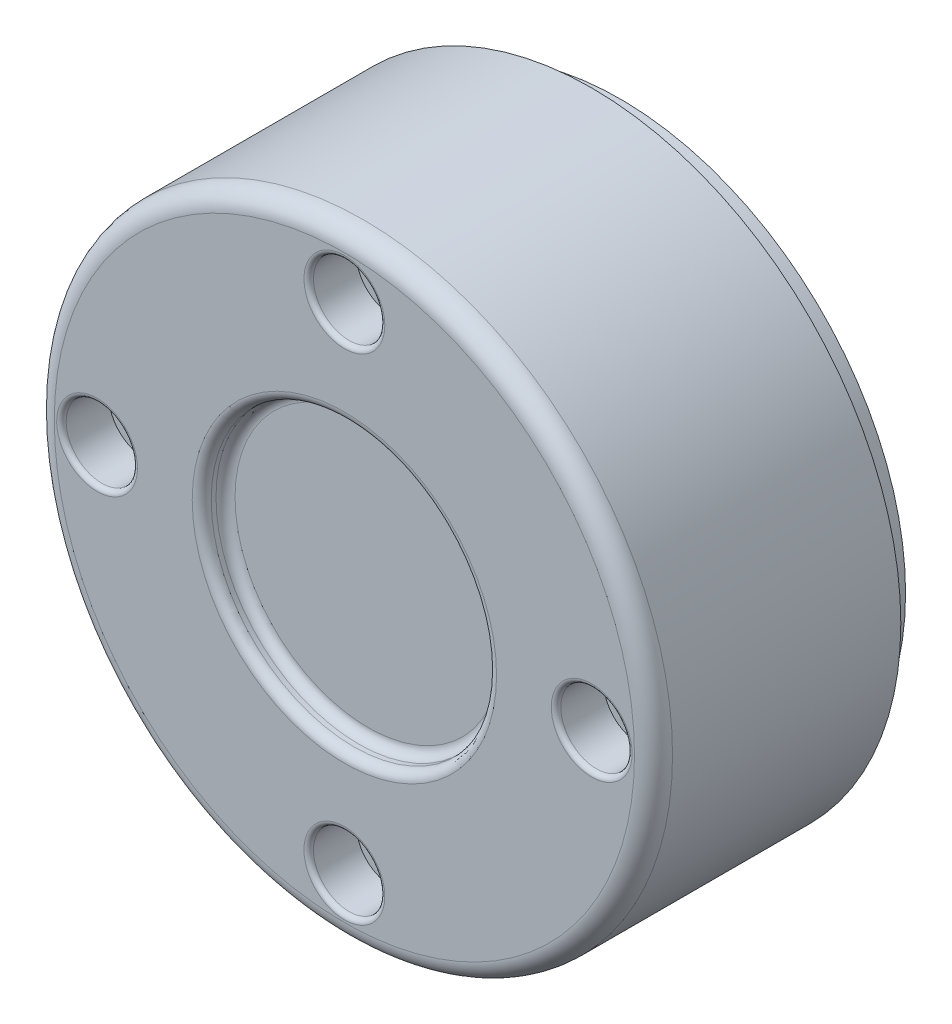
ISO-10303-21;
HEADER;
FILE_DESCRIPTION(('STEP AP214'),'2;1');
FILE_NAME('part.step','',(''),(''),'','','');
FILE_SCHEMA(('AUTOMOTIVE_DESIGN { 1 0 10303 214 1 1 1 1 }'));
ENDSEC;
DATA;
#1=APPLICATION_CONTEXT('core data for automotive mechanical design processes');
#2=APPLICATION_PROTOCOL_DEFINITION('international standard','automotive_design',2000,#1);
#3=PRODUCT_CONTEXT('',#1,'mechanical');
#4=PRODUCT('Part','Part','',(#3));
#5=PRODUCT_RELATED_PRODUCT_CATEGORY('part','',(#4));
#6=PRODUCT_DEFINITION_FORMATION('','',#4);
#7=PRODUCT_DEFINITION_CONTEXT('part definition',#1,'design');
#8=PRODUCT_DEFINITION('design','',#6,#7);
#9=PRODUCT_DEFINITION_SHAPE('','',#8);
#10=(LENGTH_UNIT() NAMED_UNIT(*) SI_UNIT(.MILLI.,.METRE.));
#11=(NAMED_UNIT(*) PLANE_ANGLE_UNIT() SI_UNIT($,.RADIAN.));
#12=(NAMED_UNIT(*) SI_UNIT($,.STERADIAN.) SOLID_ANGLE_UNIT());
#13=UNCERTAINTY_MEASURE_WITH_UNIT(LENGTH_MEASURE(1.E-05),#10,'distance_accuracy_value','');
#14=(GEOMETRIC_REPRESENTATION_CONTEXT(3) GLOBAL_UNCERTAINTY_ASSIGNED_CONTEXT((#13)) GLOBAL_UNIT_ASSIGNED_CONTEXT((#10,
#11,#12)) REPRESENTATION_CONTEXT('',''));
#15=CARTESIAN_POINT('',(0.,0.,0.));
#16=DIRECTION('',(0.,0.,1.));
#17=DIRECTION('',(1.,0.,0.));
#18=AXIS2_PLACEMENT_3D('',#15,#16,#17);
#19=CARTESIAN_POINT('',(0.,0.,-29.));
#20=DIRECTION('',(0.,0.,-1.));
#21=DIRECTION('',(-1.,0.,0.));
#22=AXIS2_PLACEMENT_3D('',#19,#20,#21);
#23=PLANE('',#22);
#24=CARTESIAN_POINT('',(0.,0.,-29.));
#25=DIRECTION('',(0.,0.,-1.));
#26=DIRECTION('',(-1.,0.,0.));
#27=AXIS2_PLACEMENT_3D('',#24,#25,#26);
#28=CIRCLE('',#27,28.);
#29=CARTESIAN_POINT('',(-28.,0.,-29.));
#30=VERTEX_POINT('',#29);
#31=EDGE_CURVE('E146',#30,#30,#28,.F.);
#32=ORIENTED_EDGE('',*,*,#31,.T.);
#33=EDGE_LOOP('',(#32));
#34=FACE_BOUND('',#33,.T.);
#35=CARTESIAN_POINT('',(0.,0.,-29.));
#36=DIRECTION('',(0.,0.,1.));
#37=DIRECTION('',(1.,0.,0.));
#38=AXIS2_PLACEMENT_3D('',#35,#36,#37);
#39=CIRCLE('',#38,30.);
#40=CARTESIAN_POINT('',(30.,0.,-29.));
#41=VERTEX_POINT('',#40);
#42=EDGE_CURVE('E217',#41,#41,#39,.T.);
#43=ORIENTED_EDGE('',*,*,#42,.F.);
#44=EDGE_LOOP('',(#43));
#45=FACE_BOUND('',#44,.T.);
#46=ADVANCED_FACE('F40',(#34,#45),#23,.T.);
#47=CARTESIAN_POINT('',(0.,0.,-2.5));
#48=DIRECTION('',(0.,0.,1.));
#49=DIRECTION('',(1.,0.,0.));
#50=AXIS2_PLACEMENT_3D('',#47,#48,#49);
#51=CYLINDRICAL_SURFACE('',#50,30.);
#52=ORIENTED_EDGE('',*,*,#42,.T.);
#53=EDGE_LOOP('',(#52));
#54=FACE_BOUND('',#53,.T.);
#55=CARTESIAN_POINT('',(0.,0.,-26.));
#56=DIRECTION('',(0.,0.,1.));
#57=DIRECTION('',(1.,0.,0.));
#58=AXIS2_PLACEMENT_3D('',#55,#56,#57);
#59=CIRCLE('',#58,30.);
#60=CARTESIAN_POINT('',(30.,0.,-26.));
#61=VERTEX_POINT('',#60);
#62=EDGE_CURVE('E214',#61,#61,#59,.T.);
#63=ORIENTED_EDGE('',*,*,#62,.F.);
#64=EDGE_LOOP('',(#63));
#65=FACE_BOUND('',#64,.T.);
#66=ADVANCED_FACE('F258',(#54,#65),#51,.T.);
#67=CARTESIAN_POINT('',(30.,0.,-26.));
#68=DIRECTION('',(0.,0.,-1.));
#69=DIRECTION('',(-1.,0.,0.));
#70=AXIS2_PLACEMENT_3D('',#67,#68,#69);
#71=PLANE('',#70);
#72=ORIENTED_EDGE('',*,*,#62,.T.);
#73=EDGE_LOOP('',(#72));
#74=FACE_BOUND('',#73,.T.);
#75=CARTESIAN_POINT('',(0.,0.,-26.));
#76=DIRECTION('',(0.,0.,1.));
#77=DIRECTION('',(1.,0.,0.));
#78=AXIS2_PLACEMENT_3D('',#75,#76,#77);
#79=CIRCLE('',#78,32.5);
#80=CARTESIAN_POINT('',(32.5,0.,-26.));
#81=VERTEX_POINT('',#80);
#82=EDGE_CURVE('E211',#81,#81,#79,.T.);
#83=ORIENTED_EDGE('',*,*,#82,.F.);
#84=EDGE_LOOP('',(#83));
#85=FACE_BOUND('',#84,.T.);
#86=ADVANCED_FACE('F264',(#74,#85),#71,.T.);
#87=CARTESIAN_POINT('',(0.,0.,-2.5));
#88=DIRECTION('',(0.,0.,1.));
#89=DIRECTION('',(1.,0.,0.));
#90=AXIS2_PLACEMENT_3D('',#87,#88,#89);
#91=CYLINDRICAL_SURFACE('',#90,32.5);
#92=CARTESIAN_POINT('',(0.,0.,-2.));
#93=DIRECTION('',(0.,0.,1.));
#94=DIRECTION('',(1.,0.,0.));
#95=AXIS2_PLACEMENT_3D('',#92,#93,#94);
#96=CIRCLE('',#95,32.5);
#97=CARTESIAN_POINT('',(32.5,0.,-2.));
#98=VERTEX_POINT('',#97);
#99=EDGE_CURVE('E13',#98,#98,#96,.F.);
#100=ORIENTED_EDGE('',*,*,#99,.T.);
#101=EDGE_LOOP('',(#100));
#102=FACE_BOUND('',#101,.T.);
#103=ORIENTED_EDGE('',*,*,#82,.T.);
#104=EDGE_LOOP('',(#103));
#105=FACE_BOUND('',#104,.T.);
#106=ADVANCED_FACE('F310',(#102,#105),#91,.T.);
#107=CARTESIAN_POINT('',(32.5,0.,0.));
#108=DIRECTION('',(0.,0.,1.));
#109=DIRECTION('',(1.,0.,0.));
#110=AXIS2_PLACEMENT_3D('',#107,#108,#109);
#111=PLANE('',#110);
#112=CARTESIAN_POINT('',(0.,0.,0.));
#113=DIRECTION('',(0.,0.,1.));
#114=DIRECTION('',(1.,0.,0.));
#115=AXIS2_PLACEMENT_3D('',#112,#113,#114);
#116=CIRCLE('',#115,30.5);
#117=CARTESIAN_POINT('',(30.5,0.,0.));
#118=VERTEX_POINT('',#117);
#119=EDGE_CURVE('E48',#118,#118,#116,.T.);
#120=ORIENTED_EDGE('',*,*,#119,.T.);
#121=EDGE_LOOP('',(#120));
#122=FACE_BOUND('',#121,.T.);
#123=CARTESIAN_POINT('',(0.,0.,0.));
#124=DIRECTION('',(0.,0.,1.));
#125=DIRECTION('',(1.,0.,0.));
#126=AXIS2_PLACEMENT_3D('',#123,#124,#125);
#127=CIRCLE('',#126,16.);
#128=CARTESIAN_POINT('',(16.,0.,0.));
#129=VERTEX_POINT('',#128);
#130=EDGE_CURVE('E232',#129,#129,#127,.F.);
#131=ORIENTED_EDGE('',*,*,#130,.T.);
#132=EDGE_LOOP('',(#131));
#133=FACE_BOUND('',#132,.T.);
#134=CARTESIAN_POINT('',(-26.,0.,0.));
#135=DIRECTION('',(0.,0.,1.));
#136=DIRECTION('',(0.,1.,0.));
#137=AXIS2_PLACEMENT_3D('',#134,#135,#136);
#138=CIRCLE('',#137,4.25);
#139=CARTESIAN_POINT('',(-26.,4.24999999999991,0.));
#140=VERTEX_POINT('',#139);
#141=EDGE_CURVE('E182',#140,#140,#138,.F.);
#142=ORIENTED_EDGE('',*,*,#141,.T.);
#143=EDGE_LOOP('',(#142));
#144=FACE_BOUND('',#143,.T.);
#145=CARTESIAN_POINT('',(0.,-26.,0.));
#146=DIRECTION('',(0.,0.,1.));
#147=DIRECTION('',(-1.,0.,0.));
#148=AXIS2_PLACEMENT_3D('',#145,#146,#147);
#149=CIRCLE('',#148,4.25);
#150=CARTESIAN_POINT('',(-4.25,-26.,0.));
#151=VERTEX_POINT('',#150);
#152=EDGE_CURVE('E193',#151,#151,#149,.F.);
#153=ORIENTED_EDGE('',*,*,#152,.T.);
#154=EDGE_LOOP('',(#153));
#155=FACE_BOUND('',#154,.T.);
#156=CARTESIAN_POINT('',(26.,2.72335544429764E-13,0.));
#157=DIRECTION('',(0.,0.,1.));
#158=DIRECTION('',(0.,-1.,0.));
#159=AXIS2_PLACEMENT_3D('',#156,#157,#158);
#160=CIRCLE('',#159,4.25);
#161=CARTESIAN_POINT('',(26.,-4.24999999999973,0.));
#162=VERTEX_POINT('',#161);
#163=EDGE_CURVE('E179',#162,#162,#160,.F.);
#164=ORIENTED_EDGE('',*,*,#163,.T.);
#165=EDGE_LOOP('',(#164));
#166=FACE_BOUND('',#165,.T.);
#167=CARTESIAN_POINT('',(0.,26.,0.));
#168=DIRECTION('',(0.,0.,1.));
#169=DIRECTION('',(1.,0.,0.));
#170=AXIS2_PLACEMENT_3D('',#167,#168,#169);
#171=CIRCLE('',#170,4.25);
#172=CARTESIAN_POINT('',(4.25,26.,0.));
#173=VERTEX_POINT('',#172);
#174=EDGE_CURVE('E223',#173,#173,#171,.F.);
#175=ORIENTED_EDGE('',*,*,#174,.T.);
#176=EDGE_LOOP('',(#175));
#177=FACE_BOUND('',#176,.T.);
#178=ADVANCED_FACE('F240',(#122,#133,#144,#155,#166,#177),#111,.T.);
#179=CARTESIAN_POINT('',(0.,0.,-2.5));
#180=DIRECTION('',(0.,0.,1.));
#181=DIRECTION('',(1.,0.,0.));
#182=AXIS2_PLACEMENT_3D('',#179,#180,#181);
#183=CYLINDRICAL_SURFACE('',#182,15.);
#184=CARTESIAN_POINT('',(0.,0.,-1.));
#185=DIRECTION('',(0.,0.,1.));
#186=DIRECTION('',(1.,0.,0.));
#187=AXIS2_PLACEMENT_3D('',#184,#185,#186);
#188=CIRCLE('',#187,15.);
#189=CARTESIAN_POINT('',(15.,0.,-1.));
#190=VERTEX_POINT('',#189);
#191=EDGE_CURVE('E229',#190,#190,#188,.T.);
#192=ORIENTED_EDGE('',*,*,#191,.T.);
#193=EDGE_LOOP('',(#192));
#194=FACE_BOUND('',#193,.T.);
#195=CARTESIAN_POINT('',(0.,0.,-1.5));
#196=DIRECTION('',(0.,0.,1.));
#197=DIRECTION('',(1.,0.,0.));
#198=AXIS2_PLACEMENT_3D('',#195,#196,#197);
#199=CIRCLE('',#198,15.);
#200=CARTESIAN_POINT('',(15.,0.,-1.5));
#201=VERTEX_POINT('',#200);
#202=EDGE_CURVE('E226',#201,#201,#199,.F.);
#203=ORIENTED_EDGE('',*,*,#202,.T.);
#204=EDGE_LOOP('',(#203));
#205=FACE_BOUND('',#204,.T.);
#206=ADVANCED_FACE('F289',(#194,#205),#183,.F.);
#207=CARTESIAN_POINT('',(15.,0.,-2.5));
#208=DIRECTION('',(0.,0.,1.));
#209=DIRECTION('',(1.,0.,0.));
#210=AXIS2_PLACEMENT_3D('',#207,#208,#209);
#211=PLANE('',#210);
#212=CARTESIAN_POINT('',(0.,0.,-2.5));
#213=DIRECTION('',(0.,0.,1.));
#214=DIRECTION('',(1.,0.,0.));
#215=AXIS2_PLACEMENT_3D('',#212,#213,#214);
#216=CIRCLE('',#215,14.);
#217=CARTESIAN_POINT('',(14.,0.,-2.5));
#218=VERTEX_POINT('',#217);
#219=EDGE_CURVE('E235',#218,#218,#216,.T.);
#220=ORIENTED_EDGE('',*,*,#219,.T.);
#221=EDGE_LOOP('',(#220));
#222=FACE_BOUND('',#221,.T.);
#223=ADVANCED_FACE('F292',(#222),#211,.T.);
#224=CARTESIAN_POINT('',(0.,26.,-5.));
#225=DIRECTION('',(0.,0.,1.));
#226=DIRECTION('',(1.,0.,0.));
#227=AXIS2_PLACEMENT_3D('',#224,#225,#226);
#228=CYLINDRICAL_SURFACE('',#227,3.75);
#229=CARTESIAN_POINT('',(0.,26.,-0.5));
#230=DIRECTION('',(0.,0.,1.));
#231=DIRECTION('',(1.,0.,0.));
#232=AXIS2_PLACEMENT_3D('',#229,#230,#231);
#233=CIRCLE('',#232,3.75);
#234=CARTESIAN_POINT('',(3.75,26.,-0.5));
#235=VERTEX_POINT('',#234);
#236=EDGE_CURVE('E220',#235,#235,#233,.T.);
#237=ORIENTED_EDGE('',*,*,#236,.T.);
#238=EDGE_LOOP('',(#237));
#239=FACE_BOUND('',#238,.T.);
#240=CARTESIAN_POINT('',(0.,26.,-5.));
#241=DIRECTION('',(0.,0.,1.));
#242=DIRECTION('',(1.,0.,0.));
#243=AXIS2_PLACEMENT_3D('',#240,#241,#242);
#244=CIRCLE('',#243,3.75);
#245=CARTESIAN_POINT('',(3.75,26.,-5.));
#246=VERTEX_POINT('',#245);
#247=EDGE_CURVE('E192',#246,#246,#244,.T.);
#248=ORIENTED_EDGE('',*,*,#247,.F.);
#249=EDGE_LOOP('',(#248));
#250=FACE_BOUND('',#249,.T.);
#251=ADVANCED_FACE('F299',(#239,#250),#228,.F.);
#252=CARTESIAN_POINT('',(0.,26.,-5.));
#253=DIRECTION('',(0.,0.,1.));
#254=DIRECTION('',(1.,0.,0.));
#255=AXIS2_PLACEMENT_3D('',#252,#253,#254);
#256=PLANE('',#255);
#257=ORIENTED_EDGE('',*,*,#247,.T.);
#258=EDGE_LOOP('',(#257));
#259=FACE_BOUND('',#258,.T.);
#260=ADVANCED_FACE('F274',(#259),#256,.T.);
#261=CARTESIAN_POINT('',(0.,26.,-0.5));
#262=DIRECTION('',(0.,0.,1.));
#263=DIRECTION('',(1.,0.,0.));
#264=AXIS2_PLACEMENT_3D('',#261,#262,#263);
#265=TOROIDAL_SURFACE('',#264,4.25,0.5);
#266=ORIENTED_EDGE('',*,*,#174,.F.);
#267=EDGE_LOOP('',(#266));
#268=FACE_BOUND('',#267,.T.);
#269=ORIENTED_EDGE('',*,*,#236,.F.);
#270=EDGE_LOOP('',(#269));
#271=FACE_BOUND('',#270,.T.);
#272=ADVANCED_FACE('F270',(#268,#271),#265,.T.);
#273=CARTESIAN_POINT('',(26.,2.72335544429764E-13,-5.));
#274=DIRECTION('',(0.,0.,1.));
#275=DIRECTION('',(0.,-1.,0.));
#276=AXIS2_PLACEMENT_3D('',#273,#274,#275);
#277=PLANE('',#276);
#278=CARTESIAN_POINT('',(26.,2.72335544429764E-13,-5.));
#279=DIRECTION('',(0.,0.,1.));
#280=DIRECTION('',(0.,-1.,0.));
#281=AXIS2_PLACEMENT_3D('',#278,#279,#280);
#282=CIRCLE('',#281,3.75);
#283=CARTESIAN_POINT('',(26.,-3.74999999999973,-5.));
#284=VERTEX_POINT('',#283);
#285=EDGE_CURVE('E197',#284,#284,#282,.T.);
#286=ORIENTED_EDGE('',*,*,#285,.T.);
#287=EDGE_LOOP('',(#286));
#288=FACE_BOUND('',#287,.T.);
#289=ADVANCED_FACE('F273',(#288),#277,.T.);
#290=CARTESIAN_POINT('',(26.,2.72335544429764E-13,-5.));
#291=DIRECTION('',(0.,0.,1.));
#292=DIRECTION('',(0.,-1.,0.));
#293=AXIS2_PLACEMENT_3D('',#290,#291,#292);
#294=CYLINDRICAL_SURFACE('',#293,3.75);
#295=CARTESIAN_POINT('',(26.,2.72335544429764E-13,-0.5));
#296=DIRECTION('',(0.,0.,1.));
#297=DIRECTION('',(0.,-1.,0.));
#298=AXIS2_PLACEMENT_3D('',#295,#296,#297);
#299=CIRCLE('',#298,3.75);
#300=CARTESIAN_POINT('',(26.,-3.74999999999973,-0.5));
#301=VERTEX_POINT('',#300);
#302=EDGE_CURVE('E204',#301,#301,#299,.T.);
#303=ORIENTED_EDGE('',*,*,#302,.T.);
#304=EDGE_LOOP('',(#303));
#305=FACE_BOUND('',#304,.T.);
#306=ORIENTED_EDGE('',*,*,#285,.F.);
#307=EDGE_LOOP('',(#306));
#308=FACE_BOUND('',#307,.T.);
#309=ADVANCED_FACE('F517',(#305,#308),#294,.F.);
#310=CARTESIAN_POINT('',(26.,2.72335544429764E-13,-0.5));
#311=DIRECTION('',(0.,0.,1.));
#312=DIRECTION('',(0.,-1.,0.));
#313=AXIS2_PLACEMENT_3D('',#310,#311,#312);
#314=TOROIDAL_SURFACE('',#313,4.25,0.5);
#315=ORIENTED_EDGE('',*,*,#163,.F.);
#316=EDGE_LOOP('',(#315));
#317=FACE_BOUND('',#316,.T.);
#318=ORIENTED_EDGE('',*,*,#302,.F.);
#319=EDGE_LOOP('',(#318));
#320=FACE_BOUND('',#319,.T.);
#321=ADVANCED_FACE('F513',(#317,#320),#314,.T.);
#322=CARTESIAN_POINT('',(0.,-26.,-5.));
#323=DIRECTION('',(0.,0.,1.));
#324=DIRECTION('',(-1.,0.,0.));
#325=AXIS2_PLACEMENT_3D('',#322,#323,#324);
#326=PLANE('',#325);
#327=CARTESIAN_POINT('',(0.,-26.,-5.));
#328=DIRECTION('',(0.,0.,1.));
#329=DIRECTION('',(-1.,0.,0.));
#330=AXIS2_PLACEMENT_3D('',#327,#328,#329);
#331=CIRCLE('',#330,3.75);
#332=CARTESIAN_POINT('',(-3.75,-26.,-5.));
#333=VERTEX_POINT('',#332);
#334=EDGE_CURVE('E186',#333,#333,#331,.T.);
#335=ORIENTED_EDGE('',*,*,#334,.T.);
#336=EDGE_LOOP('',(#335));
#337=FACE_BOUND('',#336,.T.);
#338=ADVANCED_FACE('F509',(#337),#326,.T.);
#339=CARTESIAN_POINT('',(0.,-26.,-5.));
#340=DIRECTION('',(0.,0.,1.));
#341=DIRECTION('',(-1.,0.,0.));
#342=AXIS2_PLACEMENT_3D('',#339,#340,#341);
#343=CYLINDRICAL_SURFACE('',#342,3.75);
#344=CARTESIAN_POINT('',(0.,-26.,-0.5));
#345=DIRECTION('',(0.,0.,1.));
#346=DIRECTION('',(-1.,0.,0.));
#347=AXIS2_PLACEMENT_3D('',#344,#345,#346);
#348=CIRCLE('',#347,3.75);
#349=CARTESIAN_POINT('',(-3.75,-26.,-0.5));
#350=VERTEX_POINT('',#349);
#351=EDGE_CURVE('E196',#350,#350,#348,.T.);
#352=ORIENTED_EDGE('',*,*,#351,.T.);
#353=EDGE_LOOP('',(#352));
#354=FACE_BOUND('',#353,.T.);
#355=ORIENTED_EDGE('',*,*,#334,.F.);
#356=EDGE_LOOP('',(#355));
#357=FACE_BOUND('',#356,.T.);
#358=ADVANCED_FACE('F505',(#354,#357),#343,.F.);
#359=CARTESIAN_POINT('',(0.,-26.,-0.5));
#360=DIRECTION('',(0.,0.,1.));
#361=DIRECTION('',(-1.,0.,0.));
#362=AXIS2_PLACEMENT_3D('',#359,#360,#361);
#363=TOROIDAL_SURFACE('',#362,4.25,0.5);
#364=ORIENTED_EDGE('',*,*,#152,.F.);
#365=EDGE_LOOP('',(#364));
#366=FACE_BOUND('',#365,.T.);
#367=ORIENTED_EDGE('',*,*,#351,.F.);
#368=EDGE_LOOP('',(#367));
#369=FACE_BOUND('',#368,.T.);
#370=ADVANCED_FACE('F501',(#366,#369),#363,.T.);
#371=CARTESIAN_POINT('',(-26.,0.,-5.));
#372=DIRECTION('',(0.,0.,1.));
#373=DIRECTION('',(0.,1.,0.));
#374=AXIS2_PLACEMENT_3D('',#371,#372,#373);
#375=PLANE('',#374);
#376=CARTESIAN_POINT('',(-26.,0.,-5.));
#377=DIRECTION('',(0.,0.,1.));
#378=DIRECTION('',(0.,1.,0.));
#379=AXIS2_PLACEMENT_3D('',#376,#377,#378);
#380=CIRCLE('',#379,3.75);
#381=CARTESIAN_POINT('',(-26.,3.74999999999991,-5.));
#382=VERTEX_POINT('',#381);
#383=EDGE_CURVE('E189',#382,#382,#380,.T.);
#384=ORIENTED_EDGE('',*,*,#383,.T.);
#385=EDGE_LOOP('',(#384));
#386=FACE_BOUND('',#385,.T.);
#387=ADVANCED_FACE('F497',(#386),#375,.T.);
#388=CARTESIAN_POINT('',(-26.,0.,-5.));
#389=DIRECTION('',(0.,0.,1.));
#390=DIRECTION('',(0.,1.,0.));
#391=AXIS2_PLACEMENT_3D('',#388,#389,#390);
#392=CYLINDRICAL_SURFACE('',#391,3.75);
#393=CARTESIAN_POINT('',(-26.,0.,-0.5));
#394=DIRECTION('',(0.,0.,1.));
#395=DIRECTION('',(0.,1.,0.));
#396=AXIS2_PLACEMENT_3D('',#393,#394,#395);
#397=CIRCLE('',#396,3.75);
#398=CARTESIAN_POINT('',(-26.,3.74999999999991,-0.5));
#399=VERTEX_POINT('',#398);
#400=EDGE_CURVE('E185',#399,#399,#397,.T.);
#401=ORIENTED_EDGE('',*,*,#400,.T.);
#402=EDGE_LOOP('',(#401));
#403=FACE_BOUND('',#402,.T.);
#404=ORIENTED_EDGE('',*,*,#383,.F.);
#405=EDGE_LOOP('',(#404));
#406=FACE_BOUND('',#405,.T.);
#407=ADVANCED_FACE('F282',(#403,#406),#392,.F.);
#408=CARTESIAN_POINT('',(-26.,0.,-0.5));
#409=DIRECTION('',(0.,0.,1.));
#410=DIRECTION('',(0.,1.,0.));
#411=AXIS2_PLACEMENT_3D('',#408,#409,#410);
#412=TOROIDAL_SURFACE('',#411,4.25,0.5);
#413=ORIENTED_EDGE('',*,*,#141,.F.);
#414=EDGE_LOOP('',(#413));
#415=FACE_BOUND('',#414,.T.);
#416=ORIENTED_EDGE('',*,*,#400,.F.);
#417=EDGE_LOOP('',(#416));
#418=FACE_BOUND('',#417,.T.);
#419=ADVANCED_FACE('F277',(#415,#418),#412,.T.);
#420=CARTESIAN_POINT('',(0.,0.,-1.));
#421=DIRECTION('',(0.,0.,1.));
#422=DIRECTION('',(1.,0.,0.));
#423=AXIS2_PLACEMENT_3D('',#420,#421,#422);
#424=TOROIDAL_SURFACE('',#423,16.,1.);
#425=ORIENTED_EDGE('',*,*,#130,.F.);
#426=EDGE_LOOP('',(#425));
#427=FACE_BOUND('',#426,.T.);
#428=ORIENTED_EDGE('',*,*,#191,.F.);
#429=EDGE_LOOP('',(#428));
#430=FACE_BOUND('',#429,.T.);
#431=ADVANCED_FACE('F254',(#427,#430),#424,.T.);
#432=CARTESIAN_POINT('',(0.,0.,-1.5));
#433=DIRECTION('',(0.,0.,1.));
#434=DIRECTION('',(1.,0.,0.));
#435=AXIS2_PLACEMENT_3D('',#432,#433,#434);
#436=TOROIDAL_SURFACE('',#435,14.,1.);
#437=ORIENTED_EDGE('',*,*,#202,.F.);
#438=EDGE_LOOP('',(#437));
#439=FACE_BOUND('',#438,.T.);
#440=ORIENTED_EDGE('',*,*,#219,.F.);
#441=EDGE_LOOP('',(#440));
#442=FACE_BOUND('',#441,.T.);
#443=ADVANCED_FACE('F245',(#439,#442),#436,.F.);
#444=CARTESIAN_POINT('',(0.,0.,-2.));
#445=DIRECTION('',(0.,0.,1.));
#446=DIRECTION('',(1.,0.,0.));
#447=AXIS2_PLACEMENT_3D('',#444,#445,#446);
#448=TOROIDAL_SURFACE('',#447,30.5,2.);
#449=ORIENTED_EDGE('',*,*,#99,.F.);
#450=EDGE_LOOP('',(#449));
#451=FACE_BOUND('',#450,.T.);
#452=ORIENTED_EDGE('',*,*,#119,.F.);
#453=EDGE_LOOP('',(#452));
#454=FACE_BOUND('',#453,.T.);
#455=ADVANCED_FACE('F42',(#451,#454),#448,.T.);
#456=CARTESIAN_POINT('',(0.,0.,-2.5));
#457=DIRECTION('',(0.,0.,1.));
#458=DIRECTION('',(1.,0.,0.));
#459=AXIS2_PLACEMENT_3D('',#456,#457,#458);
#460=CYLINDRICAL_SURFACE('',#459,28.);
#461=ORIENTED_EDGE('',*,*,#31,.F.);
#462=EDGE_LOOP('',(#461));
#463=FACE_BOUND('',#462,.T.);
#464=CARTESIAN_POINT('',(0.,0.,-24.));
#465=DIRECTION('',(0.,0.,-1.));
#466=DIRECTION('',(-1.,0.,0.));
#467=AXIS2_PLACEMENT_3D('',#464,#465,#466);
#468=CIRCLE('',#467,28.);
#469=CARTESIAN_POINT('',(-28.,0.,-24.));
#470=VERTEX_POINT('',#469);
#471=EDGE_CURVE('E156',#470,#470,#468,.F.);
#472=ORIENTED_EDGE('',*,*,#471,.T.);
#473=EDGE_LOOP('',(#472));
#474=FACE_BOUND('',#473,.T.);
#475=ADVANCED_FACE('F244',(#463,#474),#460,.F.);
#476=CARTESIAN_POINT('',(30.,0.,-24.));
#477=DIRECTION('',(0.,0.,-1.));
#478=DIRECTION('',(-1.,0.,0.));
#479=AXIS2_PLACEMENT_3D('',#476,#477,#478);
#480=PLANE('',#479);
#481=ORIENTED_EDGE('',*,*,#471,.F.);
#482=EDGE_LOOP('',(#481));
#483=FACE_BOUND('',#482,.T.);
#484=CARTESIAN_POINT('',(0.,0.,-24.));
#485=DIRECTION('',(0.,0.,-1.));
#486=DIRECTION('',(-1.,0.,0.));
#487=AXIS2_PLACEMENT_3D('',#484,#485,#486);
#488=CIRCLE('',#487,30.5);
#489=CARTESIAN_POINT('',(-30.5,0.,-24.));
#490=VERTEX_POINT('',#489);
#491=EDGE_CURVE('E151',#490,#490,#488,.F.);
#492=ORIENTED_EDGE('',*,*,#491,.T.);
#493=EDGE_LOOP('',(#492));
#494=FACE_BOUND('',#493,.T.);
#495=ADVANCED_FACE('F251',(#483,#494),#480,.F.);
#496=CARTESIAN_POINT('',(0.,0.,-2.5));
#497=DIRECTION('',(0.,0.,1.));
#498=DIRECTION('',(1.,0.,0.));
#499=AXIS2_PLACEMENT_3D('',#496,#497,#498);
#500=CYLINDRICAL_SURFACE('',#499,30.5);
#501=DIRECTION('',(0.,0.,1.));
#502=VECTOR('',#501,1.);
#503=CARTESIAN_POINT('',(-30.2536057692308,-3.86902286888658,-5.));
#504=LINE('',#503,#502);
#505=CARTESIAN_POINT('',(-30.2536057692308,-3.86902286888658,-7.));
#506=VERTEX_POINT('',#505);
#507=CARTESIAN_POINT('',(-30.2536057692308,-3.86902286888658,-2.));
#508=VERTEX_POINT('',#507);
#509=EDGE_CURVE('E63',#506,#508,#504,.T.);
#510=ORIENTED_EDGE('',*,*,#509,.T.);
#511=CARTESIAN_POINT('',(0.,0.,-2.));
#512=DIRECTION('',(0.,0.,1.));
#513=DIRECTION('',(1.,0.,0.));
#514=AXIS2_PLACEMENT_3D('',#511,#512,#513);
#515=CIRCLE('',#514,30.5);
#516=CARTESIAN_POINT('',(-3.8690228688865,-30.2536057692308,-2.));
#517=VERTEX_POINT('',#516);
#518=EDGE_CURVE('E122',#508,#517,#515,.T.);
#519=ORIENTED_EDGE('',*,*,#518,.T.);
#520=DIRECTION('',(0.,0.,1.));
#521=VECTOR('',#520,1.);
#522=CARTESIAN_POINT('',(-3.8690228688865,-30.2536057692308,-2.5));
#523=LINE('',#522,#521);
#524=CARTESIAN_POINT('',(-3.8690228688865,-30.2536057692308,-7.));
#525=VERTEX_POINT('',#524);
#526=EDGE_CURVE('E164',#525,#517,#523,.T.);
#527=ORIENTED_EDGE('',*,*,#526,.F.);
#528=CARTESIAN_POINT('',(0.,0.,-7.));
#529=DIRECTION('',(0.,0.,1.));
#530=DIRECTION('',(1.,0.,0.));
#531=AXIS2_PLACEMENT_3D('',#528,#529,#530);
#532=CIRCLE('',#531,30.5);
#533=CARTESIAN_POINT('',(3.86902286888647,-30.2536057692308,-7.));
#534=VERTEX_POINT('',#533);
#535=EDGE_CURVE('E174',#534,#525,#532,.F.);
#536=ORIENTED_EDGE('',*,*,#535,.F.);
#537=DIRECTION('',(0.,0.,1.));
#538=VECTOR('',#537,1.);
#539=CARTESIAN_POINT('',(3.86902286888647,-30.2536057692308,-5.));
#540=LINE('',#539,#538);
#541=CARTESIAN_POINT('',(3.8690228688865,-30.2536057692308,-2.));
#542=VERTEX_POINT('',#541);
#543=EDGE_CURVE('E166',#534,#542,#540,.T.);
#544=ORIENTED_EDGE('',*,*,#543,.T.);
#545=CARTESIAN_POINT('',(30.2536057692308,-3.86902286888618,-2.));
#546=VERTEX_POINT('',#545);
#547=EDGE_CURVE('E617',#542,#546,#515,.T.);
#548=ORIENTED_EDGE('',*,*,#547,.T.);
#549=DIRECTION('',(0.,0.,1.));
#550=VECTOR('',#549,1.);
#551=CARTESIAN_POINT('',(30.2536057692308,-3.86902286888618,-2.5));
#552=LINE('',#551,#550);
#553=CARTESIAN_POINT('',(30.2536057692308,-3.86902286888618,-7.));
#554=VERTEX_POINT('',#553);
#555=EDGE_CURVE('E160',#554,#546,#552,.T.);
#556=ORIENTED_EDGE('',*,*,#555,.F.);
#557=CARTESIAN_POINT('',(0.,0.,-7.));
#558=DIRECTION('',(0.,0.,1.));
#559=DIRECTION('',(1.,0.,0.));
#560=AXIS2_PLACEMENT_3D('',#557,#558,#559);
#561=CIRCLE('',#560,30.5);
#562=CARTESIAN_POINT('',(30.2536057692307,3.86902286888679,-7.));
#563=VERTEX_POINT('',#562);
#564=EDGE_CURVE('E171',#563,#554,#561,.F.);
#565=ORIENTED_EDGE('',*,*,#564,.F.);
#566=DIRECTION('',(0.,0.,1.));
#567=VECTOR('',#566,1.);
#568=CARTESIAN_POINT('',(30.2536057692307,3.86902286888679,-5.));
#569=LINE('',#568,#567);
#570=CARTESIAN_POINT('',(30.2536057692307,3.86902286888681,-2.));
#571=VERTEX_POINT('',#570);
#572=EDGE_CURVE('E162',#563,#571,#569,.T.);
#573=ORIENTED_EDGE('',*,*,#572,.T.);
#574=CARTESIAN_POINT('',(3.8690228688865,30.2536057692308,-2.));
#575=VERTEX_POINT('',#574);
#576=EDGE_CURVE('E119',#571,#575,#515,.T.);
#577=ORIENTED_EDGE('',*,*,#576,.T.);
#578=DIRECTION('',(0.,0.,1.));
#579=VECTOR('',#578,1.);
#580=CARTESIAN_POINT('',(3.8690228688865,30.2536057692308,-2.5));
#581=LINE('',#580,#579);
#582=CARTESIAN_POINT('',(3.8690228688865,30.2536057692308,-7.));
#583=VERTEX_POINT('',#582);
#584=EDGE_CURVE('E157',#583,#575,#581,.T.);
#585=ORIENTED_EDGE('',*,*,#584,.F.);
#586=CARTESIAN_POINT('',(0.,0.,-7.));
#587=DIRECTION('',(0.,0.,1.));
#588=DIRECTION('',(1.,0.,0.));
#589=AXIS2_PLACEMENT_3D('',#586,#587,#588);
#590=CIRCLE('',#589,30.5);
#591=CARTESIAN_POINT('',(-3.86902286888647,30.2536057692308,-7.));
#592=VERTEX_POINT('',#591);
#593=EDGE_CURVE('E108',#592,#583,#590,.F.);
#594=ORIENTED_EDGE('',*,*,#593,.F.);
#595=DIRECTION('',(0.,0.,1.));
#596=VECTOR('',#595,1.);
#597=CARTESIAN_POINT('',(-3.86902286888647,30.2536057692308,-5.));
#598=LINE('',#597,#596);
#599=CARTESIAN_POINT('',(-3.8690228688865,30.2536057692308,-2.));
#600=VERTEX_POINT('',#599);
#601=EDGE_CURVE('E115',#592,#600,#598,.T.);
#602=ORIENTED_EDGE('',*,*,#601,.T.);
#603=CARTESIAN_POINT('',(-30.2536057692308,3.86902286888637,-2.));
#604=VERTEX_POINT('',#603);
#605=EDGE_CURVE('E111',#600,#604,#515,.T.);
#606=ORIENTED_EDGE('',*,*,#605,.T.);
#607=DIRECTION('',(0.,0.,1.));
#608=VECTOR('',#607,1.);
#609=CARTESIAN_POINT('',(-30.2536057692308,3.86902286888639,-2.5));
#610=LINE('',#609,#608);
#611=CARTESIAN_POINT('',(-30.2536057692308,3.86902286888639,-7.));
#612=VERTEX_POINT('',#611);
#613=EDGE_CURVE('E55',#612,#604,#610,.T.);
#614=ORIENTED_EDGE('',*,*,#613,.F.);
#615=CARTESIAN_POINT('',(0.,0.,-7.));
#616=DIRECTION('',(0.,0.,1.));
#617=DIRECTION('',(1.,0.,0.));
#618=AXIS2_PLACEMENT_3D('',#615,#616,#617);
#619=CIRCLE('',#618,30.5);
#620=EDGE_CURVE('E177',#506,#612,#619,.F.);
#621=ORIENTED_EDGE('',*,*,#620,.F.);
#622=EDGE_LOOP('',(#510,#519,#527,#536,#544,#548,#556,#565,#573,#577,#585,#594,#602,#606,#614,#621));
#623=FACE_BOUND('',#622,.T.);
#624=ORIENTED_EDGE('',*,*,#491,.F.);
#625=EDGE_LOOP('',(#624));
#626=FACE_BOUND('',#625,.T.);
#627=ADVANCED_FACE('F112',(#623,#626),#500,.F.);
#628=CARTESIAN_POINT('',(32.5,0.,-2.));
#629=DIRECTION('',(0.,0.,1.));
#630=DIRECTION('',(1.,0.,0.));
#631=AXIS2_PLACEMENT_3D('',#628,#629,#630);
#632=PLANE('',#631);
#633=ORIENTED_EDGE('',*,*,#576,.F.);
#634=CARTESIAN_POINT('',(26.,2.72335544429764E-13,-2.));
#635=DIRECTION('',(0.,0.,1.));
#636=DIRECTION('',(1.,0.,0.));
#637=AXIS2_PLACEMENT_3D('',#634,#635,#636);
#638=CIRCLE('',#637,5.75);
#639=EDGE_CURVE('E140',#571,#546,#638,.T.);
#640=ORIENTED_EDGE('',*,*,#639,.T.);
#641=ORIENTED_EDGE('',*,*,#547,.F.);
#642=CARTESIAN_POINT('',(0.,-26.,-2.));
#643=DIRECTION('',(0.,0.,1.));
#644=DIRECTION('',(1.,0.,0.));
#645=AXIS2_PLACEMENT_3D('',#642,#643,#644);
#646=CIRCLE('',#645,5.75);
#647=EDGE_CURVE('E134',#542,#517,#646,.T.);
#648=ORIENTED_EDGE('',*,*,#647,.T.);
#649=ORIENTED_EDGE('',*,*,#518,.F.);
#650=CARTESIAN_POINT('',(-26.,0.,-2.));
#651=DIRECTION('',(0.,0.,1.));
#652=DIRECTION('',(1.,0.,0.));
#653=AXIS2_PLACEMENT_3D('',#650,#651,#652);
#654=CIRCLE('',#653,5.75);
#655=EDGE_CURVE('E105',#508,#604,#654,.T.);
#656=ORIENTED_EDGE('',*,*,#655,.T.);
#657=ORIENTED_EDGE('',*,*,#605,.F.);
#658=CARTESIAN_POINT('',(0.,26.,-2.));
#659=DIRECTION('',(0.,0.,1.));
#660=DIRECTION('',(1.,0.,0.));
#661=AXIS2_PLACEMENT_3D('',#658,#659,#660);
#662=CIRCLE('',#661,5.75);
#663=EDGE_CURVE('E143',#600,#575,#662,.T.);
#664=ORIENTED_EDGE('',*,*,#663,.T.);
#665=EDGE_LOOP('',(#633,#640,#641,#648,#649,#656,#657,#664));
#666=FACE_BOUND('',#665,.T.);
#667=CARTESIAN_POINT('',(0.,0.,-2.));
#668=DIRECTION('',(0.,0.,1.));
#669=DIRECTION('',(1.,0.,0.));
#670=AXIS2_PLACEMENT_3D('',#667,#668,#669);
#671=CIRCLE('',#670,16.9580398915498);
#672=CARTESIAN_POINT('',(16.9580398915498,0.,-2.));
#673=VERTEX_POINT('',#672);
#674=EDGE_CURVE('E145',#673,#673,#671,.F.);
#675=ORIENTED_EDGE('',*,*,#674,.F.);
#676=EDGE_LOOP('',(#675));
#677=FACE_BOUND('',#676,.T.);
#678=ADVANCED_FACE('F125',(#666,#677),#632,.F.);
#679=CARTESIAN_POINT('',(15.,0.,-4.5));
#680=DIRECTION('',(0.,0.,1.));
#681=DIRECTION('',(1.,0.,0.));
#682=AXIS2_PLACEMENT_3D('',#679,#680,#681);
#683=PLANE('',#682);
#684=CARTESIAN_POINT('',(0.,0.,-4.5));
#685=DIRECTION('',(0.,0.,1.));
#686=DIRECTION('',(1.,0.,0.));
#687=AXIS2_PLACEMENT_3D('',#684,#685,#686);
#688=CIRCLE('',#687,14.);
#689=CARTESIAN_POINT('',(14.,0.,-4.5));
#690=VERTEX_POINT('',#689);
#691=EDGE_CURVE('E120',#690,#690,#688,.T.);
#692=ORIENTED_EDGE('',*,*,#691,.F.);
#693=EDGE_LOOP('',(#692));
#694=FACE_BOUND('',#693,.T.);
#695=ADVANCED_FACE('F390',(#694),#683,.F.);
#696=CARTESIAN_POINT('',(0.,26.,-5.));
#697=DIRECTION('',(0.,0.,1.));
#698=DIRECTION('',(1.,0.,0.));
#699=AXIS2_PLACEMENT_3D('',#696,#697,#698);
#700=CYLINDRICAL_SURFACE('',#699,5.75);
#701=CARTESIAN_POINT('',(0.,26.,-7.));
#702=DIRECTION('',(0.,0.,1.));
#703=DIRECTION('',(1.,0.,0.));
#704=AXIS2_PLACEMENT_3D('',#701,#702,#703);
#705=CIRCLE('',#704,5.75);
#706=EDGE_CURVE('E131',#592,#583,#705,.T.);
#707=ORIENTED_EDGE('',*,*,#706,.T.);
#708=ORIENTED_EDGE('',*,*,#584,.T.);
#709=ORIENTED_EDGE('',*,*,#663,.F.);
#710=ORIENTED_EDGE('',*,*,#601,.F.);
#711=EDGE_LOOP('',(#707,#708,#709,#710));
#712=FACE_BOUND('',#711,.T.);
#713=ADVANCED_FACE('F398',(#712),#700,.T.);
#714=CARTESIAN_POINT('',(0.,26.,-7.));
#715=DIRECTION('',(0.,0.,1.));
#716=DIRECTION('',(1.,0.,0.));
#717=AXIS2_PLACEMENT_3D('',#714,#715,#716);
#718=PLANE('',#717);
#719=ORIENTED_EDGE('',*,*,#593,.T.);
#720=ORIENTED_EDGE('',*,*,#706,.F.);
#721=EDGE_LOOP('',(#719,#720));
#722=FACE_BOUND('',#721,.T.);
#723=ADVANCED_FACE('F407',(#722),#718,.F.);
#724=CARTESIAN_POINT('',(26.,2.72335544429764E-13,-7.));
#725=DIRECTION('',(0.,0.,1.));
#726=DIRECTION('',(0.,-1.,0.));
#727=AXIS2_PLACEMENT_3D('',#724,#725,#726);
#728=PLANE('',#727);
#729=ORIENTED_EDGE('',*,*,#564,.T.);
#730=CARTESIAN_POINT('',(26.,2.72335544429764E-13,-7.));
#731=DIRECTION('',(0.,0.,1.));
#732=DIRECTION('',(1.,0.,0.));
#733=AXIS2_PLACEMENT_3D('',#730,#731,#732);
#734=CIRCLE('',#733,5.75);
#735=EDGE_CURVE('E139',#563,#554,#734,.T.);
#736=ORIENTED_EDGE('',*,*,#735,.F.);
#737=EDGE_LOOP('',(#729,#736));
#738=FACE_BOUND('',#737,.T.);
#739=ADVANCED_FACE('F416',(#738),#728,.F.);
#740=CARTESIAN_POINT('',(26.,2.72335544429764E-13,-5.));
#741=DIRECTION('',(0.,0.,1.));
#742=DIRECTION('',(0.,-1.,0.));
#743=AXIS2_PLACEMENT_3D('',#740,#741,#742);
#744=CYLINDRICAL_SURFACE('',#743,5.75);
#745=ORIENTED_EDGE('',*,*,#735,.T.);
#746=ORIENTED_EDGE('',*,*,#555,.T.);
#747=ORIENTED_EDGE('',*,*,#639,.F.);
#748=ORIENTED_EDGE('',*,*,#572,.F.);
#749=EDGE_LOOP('',(#745,#746,#747,#748));
#750=FACE_BOUND('',#749,.T.);
#751=ADVANCED_FACE('F425',(#750),#744,.T.);
#752=CARTESIAN_POINT('',(0.,-26.,-7.));
#753=DIRECTION('',(0.,0.,1.));
#754=DIRECTION('',(-1.,0.,0.));
#755=AXIS2_PLACEMENT_3D('',#752,#753,#754);
#756=PLANE('',#755);
#757=ORIENTED_EDGE('',*,*,#535,.T.);
#758=CARTESIAN_POINT('',(0.,-26.,-7.));
#759=DIRECTION('',(0.,0.,1.));
#760=DIRECTION('',(1.,0.,0.));
#761=AXIS2_PLACEMENT_3D('',#758,#759,#760);
#762=CIRCLE('',#761,5.75);
#763=EDGE_CURVE('E129',#534,#525,#762,.T.);
#764=ORIENTED_EDGE('',*,*,#763,.F.);
#765=EDGE_LOOP('',(#757,#764));
#766=FACE_BOUND('',#765,.T.);
#767=ADVANCED_FACE('F434',(#766),#756,.F.);
#768=CARTESIAN_POINT('',(0.,-26.,-5.));
#769=DIRECTION('',(0.,0.,1.));
#770=DIRECTION('',(-1.,0.,0.));
#771=AXIS2_PLACEMENT_3D('',#768,#769,#770);
#772=CYLINDRICAL_SURFACE('',#771,5.75);
#773=ORIENTED_EDGE('',*,*,#763,.T.);
#774=ORIENTED_EDGE('',*,*,#526,.T.);
#775=ORIENTED_EDGE('',*,*,#647,.F.);
#776=ORIENTED_EDGE('',*,*,#543,.F.);
#777=EDGE_LOOP('',(#773,#774,#775,#776));
#778=FACE_BOUND('',#777,.T.);
#779=ADVANCED_FACE('F443',(#778),#772,.T.);
#780=CARTESIAN_POINT('',(-26.,0.,-7.));
#781=DIRECTION('',(0.,0.,1.));
#782=DIRECTION('',(0.,1.,0.));
#783=AXIS2_PLACEMENT_3D('',#780,#781,#782);
#784=PLANE('',#783);
#785=ORIENTED_EDGE('',*,*,#620,.T.);
#786=CARTESIAN_POINT('',(-26.,0.,-7.));
#787=DIRECTION('',(0.,0.,1.));
#788=DIRECTION('',(1.,0.,0.));
#789=AXIS2_PLACEMENT_3D('',#786,#787,#788);
#790=CIRCLE('',#789,5.75);
#791=EDGE_CURVE('E107',#506,#612,#790,.T.);
#792=ORIENTED_EDGE('',*,*,#791,.F.);
#793=EDGE_LOOP('',(#785,#792));
#794=FACE_BOUND('',#793,.T.);
#795=ADVANCED_FACE('F452',(#794),#784,.F.);
#796=CARTESIAN_POINT('',(-26.,0.,-5.));
#797=DIRECTION('',(0.,0.,1.));
#798=DIRECTION('',(0.,1.,0.));
#799=AXIS2_PLACEMENT_3D('',#796,#797,#798);
#800=CYLINDRICAL_SURFACE('',#799,5.75);
#801=ORIENTED_EDGE('',*,*,#613,.T.);
#802=ORIENTED_EDGE('',*,*,#655,.F.);
#803=ORIENTED_EDGE('',*,*,#509,.F.);
#804=ORIENTED_EDGE('',*,*,#791,.T.);
#805=EDGE_LOOP('',(#801,#802,#803,#804));
#806=FACE_BOUND('',#805,.T.);
#807=ADVANCED_FACE('F103',(#806),#800,.T.);
#808=CARTESIAN_POINT('',(0.,0.,-1.5));
#809=DIRECTION('',(0.,0.,1.));
#810=DIRECTION('',(1.,0.,0.));
#811=AXIS2_PLACEMENT_3D('',#808,#809,#810);
#812=TOROIDAL_SURFACE('',#811,14.,3.);
#813=ORIENTED_EDGE('',*,*,#674,.T.);
#814=EDGE_LOOP('',(#813));
#815=FACE_BOUND('',#814,.T.);
#816=ORIENTED_EDGE('',*,*,#691,.T.);
#817=EDGE_LOOP('',(#816));
#818=FACE_BOUND('',#817,.T.);
#819=ADVANCED_FACE('F469',(#815,#818),#812,.T.);
#820=CLOSED_SHELL('',(#46,#66,#86,#106,#178,#206,#223,#251,#260,#272,#289,#309,#321,#338,#358,
#370,#387,#407,#419,#431,#443,#455,#475,#495,#627,#678,#695,#713,#723,#739,#751,#767,#779,#795,
#807,#819));
#821=MANIFOLD_SOLID_BREP('B2',#820);
#822=ADVANCED_BREP_SHAPE_REPRESENTATION('',(#18,#821),#14);
#823=SHAPE_DEFINITION_REPRESENTATION(#9,#822);
ENDSEC;
END-ISO-10303-21;
